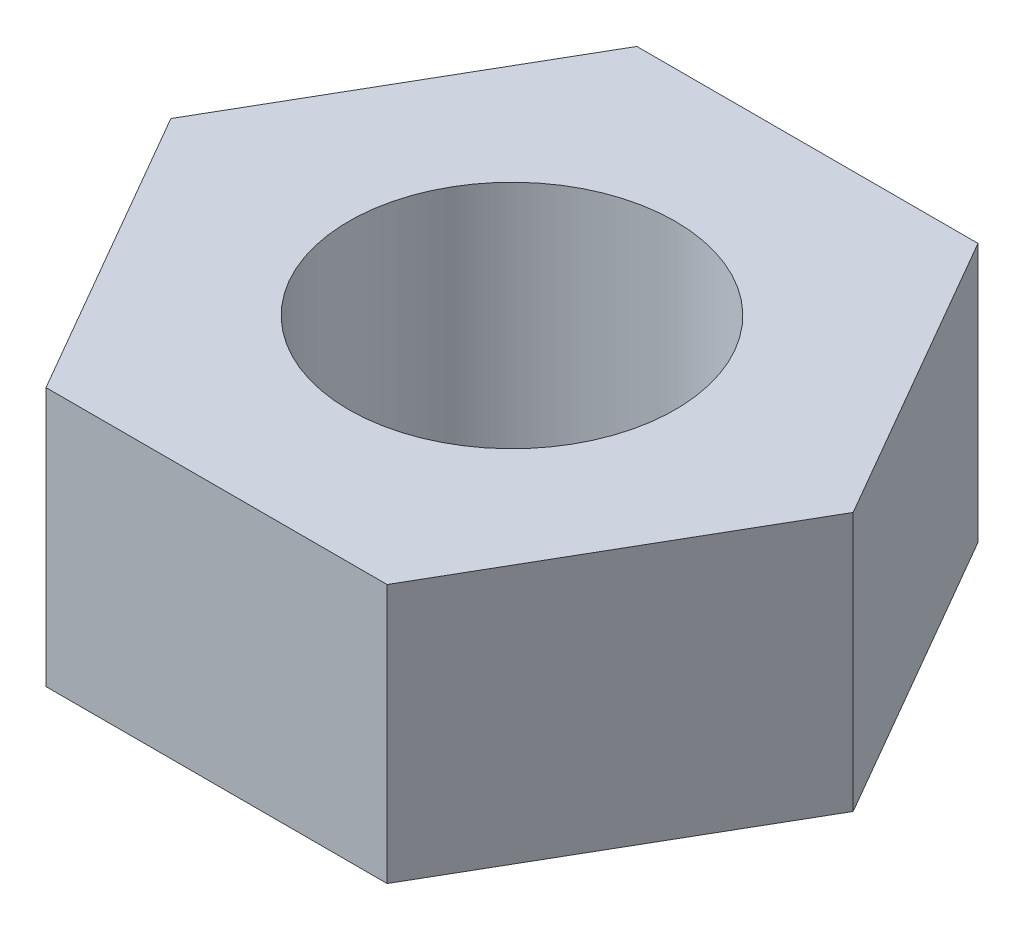
ISO-10303-21;
HEADER;
FILE_DESCRIPTION(('STEP AP214'),'2;1');
FILE_NAME('part.step','',(''),(''),'','','');
FILE_SCHEMA(('AUTOMOTIVE_DESIGN { 1 0 10303 214 1 1 1 1 }'));
ENDSEC;
DATA;
#1=APPLICATION_CONTEXT('core data for automotive mechanical design processes');
#2=APPLICATION_PROTOCOL_DEFINITION('international standard','automotive_design',2000,#1);
#3=PRODUCT_CONTEXT('',#1,'mechanical');
#4=PRODUCT('Part','Part','',(#3));
#5=PRODUCT_RELATED_PRODUCT_CATEGORY('part','',(#4));
#6=PRODUCT_DEFINITION_FORMATION('','',#4);
#7=PRODUCT_DEFINITION_CONTEXT('part definition',#1,'design');
#8=PRODUCT_DEFINITION('design','',#6,#7);
#9=PRODUCT_DEFINITION_SHAPE('','',#8);
#10=(LENGTH_UNIT() NAMED_UNIT(*) SI_UNIT(.MILLI.,.METRE.));
#11=(NAMED_UNIT(*) PLANE_ANGLE_UNIT() SI_UNIT($,.RADIAN.));
#12=(NAMED_UNIT(*) SI_UNIT($,.STERADIAN.) SOLID_ANGLE_UNIT());
#13=UNCERTAINTY_MEASURE_WITH_UNIT(LENGTH_MEASURE(1.E-05),#10,'distance_accuracy_value','');
#14=(GEOMETRIC_REPRESENTATION_CONTEXT(3) GLOBAL_UNCERTAINTY_ASSIGNED_CONTEXT((#13)) GLOBAL_UNIT_ASSIGNED_CONTEXT((#10,
#11,#12)) REPRESENTATION_CONTEXT('',''));
#15=CARTESIAN_POINT('',(0.,0.,0.));
#16=DIRECTION('',(0.,0.,1.));
#17=DIRECTION('',(1.,0.,0.));
#18=AXIS2_PLACEMENT_3D('',#15,#16,#17);
#19=CARTESIAN_POINT('',(0.,2.38,0.));
#20=DIRECTION('',(0.,1.,0.));
#21=DIRECTION('',(0.,0.,1.));
#22=AXIS2_PLACEMENT_3D('',#19,#20,#21);
#23=PLANE('',#22);
#24=DIRECTION('',(0.499999999999999,0.,-0.866025403784439));
#25=VECTOR('',#24,1.);
#26=CARTESIAN_POINT('',(1.56750598084984,2.38,2.715));
#27=LINE('',#26,#25);
#28=CARTESIAN_POINT('',(1.56750598084984,2.38,2.715));
#29=VERTEX_POINT('',#28);
#30=CARTESIAN_POINT('',(3.13501196169967,2.38,0.));
#31=VERTEX_POINT('',#30);
#32=EDGE_CURVE('E150',#29,#31,#27,.T.);
#33=ORIENTED_EDGE('',*,*,#32,.T.);
#34=DIRECTION('',(-0.5,0.,-0.866025403784439));
#35=VECTOR('',#34,1.);
#36=CARTESIAN_POINT('',(3.13501196169967,2.38,0.));
#37=LINE('',#36,#35);
#38=CARTESIAN_POINT('',(1.56750598084983,2.38,-2.715));
#39=VERTEX_POINT('',#38);
#40=EDGE_CURVE('E98',#31,#39,#37,.T.);
#41=ORIENTED_EDGE('',*,*,#40,.T.);
#42=DIRECTION('',(-1.,0.,0.));
#43=VECTOR('',#42,1.);
#44=CARTESIAN_POINT('',(1.56750598084983,2.38,-2.715));
#45=LINE('',#44,#43);
#46=CARTESIAN_POINT('',(-1.56750598084983,2.38,-2.715));
#47=VERTEX_POINT('',#46);
#48=EDGE_CURVE('E111',#39,#47,#45,.T.);
#49=ORIENTED_EDGE('',*,*,#48,.T.);
#50=DIRECTION('',(-0.5,0.,0.866025403784439));
#51=VECTOR('',#50,1.);
#52=CARTESIAN_POINT('',(-1.56750598084983,2.38,-2.715));
#53=LINE('',#52,#51);
#54=CARTESIAN_POINT('',(-3.13501196169967,2.38,0.));
#55=VERTEX_POINT('',#54);
#56=EDGE_CURVE('E105',#47,#55,#53,.T.);
#57=ORIENTED_EDGE('',*,*,#56,.T.);
#58=DIRECTION('',(0.5,0.,0.866025403784439));
#59=VECTOR('',#58,1.);
#60=CARTESIAN_POINT('',(-3.13501196169967,2.38,0.));
#61=LINE('',#60,#59);
#62=CARTESIAN_POINT('',(-1.56750598084983,2.38,2.715));
#63=VERTEX_POINT('',#62);
#64=EDGE_CURVE('E109',#55,#63,#61,.T.);
#65=ORIENTED_EDGE('',*,*,#64,.T.);
#66=DIRECTION('',(1.,0.,0.));
#67=VECTOR('',#66,1.);
#68=CARTESIAN_POINT('',(-1.56750598084983,2.38,2.715));
#69=LINE('',#68,#67);
#70=EDGE_CURVE('E61',#63,#29,#69,.T.);
#71=ORIENTED_EDGE('',*,*,#70,.T.);
#72=EDGE_LOOP('',(#33,#41,#49,#57,#65,#71));
#73=FACE_BOUND('',#72,.T.);
#74=CARTESIAN_POINT('',(0.,2.38,0.));
#75=DIRECTION('',(0.,1.,0.));
#76=DIRECTION('',(0.,0.,1.));
#77=AXIS2_PLACEMENT_3D('',#74,#75,#76);
#78=CIRCLE('',#77,1.5);
#79=CARTESIAN_POINT('',(0.,2.38,1.5));
#80=VERTEX_POINT('',#79);
#81=EDGE_CURVE('E138',#80,#80,#78,.T.);
#82=ORIENTED_EDGE('',*,*,#81,.F.);
#83=EDGE_LOOP('',(#82));
#84=FACE_BOUND('',#83,.T.);
#85=ADVANCED_FACE('F43',(#73,#84),#23,.T.);
#86=CARTESIAN_POINT('',(0.,0.,0.));
#87=DIRECTION('',(0.,1.,0.));
#88=DIRECTION('',(0.,0.,1.));
#89=AXIS2_PLACEMENT_3D('',#86,#87,#88);
#90=PLANE('',#89);
#91=DIRECTION('',(0.499999999999999,0.,-0.866025403784439));
#92=VECTOR('',#91,1.);
#93=CARTESIAN_POINT('',(1.56750598084984,0.,2.715));
#94=LINE('',#93,#92);
#95=CARTESIAN_POINT('',(1.56750598084984,0.,2.715));
#96=VERTEX_POINT('',#95);
#97=CARTESIAN_POINT('',(3.13501196169967,0.,0.));
#98=VERTEX_POINT('',#97);
#99=EDGE_CURVE('E133',#96,#98,#94,.T.);
#100=ORIENTED_EDGE('',*,*,#99,.F.);
#101=DIRECTION('',(1.,0.,0.));
#102=VECTOR('',#101,1.);
#103=CARTESIAN_POINT('',(-1.56750598084983,0.,2.715));
#104=LINE('',#103,#102);
#105=CARTESIAN_POINT('',(-1.56750598084983,0.,2.715));
#106=VERTEX_POINT('',#105);
#107=EDGE_CURVE('E90',#106,#96,#104,.T.);
#108=ORIENTED_EDGE('',*,*,#107,.F.);
#109=DIRECTION('',(0.5,0.,0.866025403784439));
#110=VECTOR('',#109,1.);
#111=CARTESIAN_POINT('',(-3.13501196169967,0.,0.));
#112=LINE('',#111,#110);
#113=CARTESIAN_POINT('',(-3.13501196169967,0.,0.));
#114=VERTEX_POINT('',#113);
#115=EDGE_CURVE('E84',#114,#106,#112,.T.);
#116=ORIENTED_EDGE('',*,*,#115,.F.);
#117=DIRECTION('',(-0.5,0.,0.866025403784439));
#118=VECTOR('',#117,1.);
#119=CARTESIAN_POINT('',(-1.56750598084983,0.,-2.715));
#120=LINE('',#119,#118);
#121=CARTESIAN_POINT('',(-1.56750598084983,0.,-2.715));
#122=VERTEX_POINT('',#121);
#123=EDGE_CURVE('E120',#122,#114,#120,.T.);
#124=ORIENTED_EDGE('',*,*,#123,.F.);
#125=DIRECTION('',(-1.,0.,0.));
#126=VECTOR('',#125,1.);
#127=CARTESIAN_POINT('',(1.56750598084983,0.,-2.715));
#128=LINE('',#127,#126);
#129=CARTESIAN_POINT('',(1.56750598084983,0.,-2.715));
#130=VERTEX_POINT('',#129);
#131=EDGE_CURVE('E141',#130,#122,#128,.T.);
#132=ORIENTED_EDGE('',*,*,#131,.F.);
#133=DIRECTION('',(-0.5,0.,-0.866025403784439));
#134=VECTOR('',#133,1.);
#135=CARTESIAN_POINT('',(3.13501196169967,0.,0.));
#136=LINE('',#135,#134);
#137=EDGE_CURVE('E137',#98,#130,#136,.T.);
#138=ORIENTED_EDGE('',*,*,#137,.F.);
#139=EDGE_LOOP('',(#100,#108,#116,#124,#132,#138));
#140=FACE_BOUND('',#139,.T.);
#141=CARTESIAN_POINT('',(0.,0.,0.));
#142=DIRECTION('',(0.,1.,0.));
#143=DIRECTION('',(0.,0.,1.));
#144=AXIS2_PLACEMENT_3D('',#141,#142,#143);
#145=CIRCLE('',#144,1.5);
#146=CARTESIAN_POINT('',(0.,0.,1.5));
#147=VERTEX_POINT('',#146);
#148=EDGE_CURVE('E265',#147,#147,#145,.T.);
#149=ORIENTED_EDGE('',*,*,#148,.T.);
#150=EDGE_LOOP('',(#149));
#151=FACE_BOUND('',#150,.T.);
#152=ADVANCED_FACE('F163',(#140,#151),#90,.F.);
#153=CARTESIAN_POINT('',(1.56750598084984,2.38,2.715));
#154=DIRECTION('',(-0.866025403784439,0.,-0.499999999999999));
#155=DIRECTION('',(-0.499999999999999,0.,0.866025403784439));
#156=AXIS2_PLACEMENT_3D('',#153,#154,#155);
#157=PLANE('',#156);
#158=ORIENTED_EDGE('',*,*,#99,.T.);
#159=DIRECTION('',(0.,-1.,0.));
#160=VECTOR('',#159,1.);
#161=CARTESIAN_POINT('',(3.13501196169967,2.38,0.));
#162=LINE('',#161,#160);
#163=EDGE_CURVE('E11',#31,#98,#162,.T.);
#164=ORIENTED_EDGE('',*,*,#163,.F.);
#165=ORIENTED_EDGE('',*,*,#32,.F.);
#166=DIRECTION('',(0.,-1.,0.));
#167=VECTOR('',#166,1.);
#168=CARTESIAN_POINT('',(1.56750598084984,2.38,2.715));
#169=LINE('',#168,#167);
#170=EDGE_CURVE('E129',#29,#96,#169,.T.);
#171=ORIENTED_EDGE('',*,*,#170,.T.);
#172=EDGE_LOOP('',(#158,#164,#165,#171));
#173=FACE_BOUND('',#172,.T.);
#174=ADVANCED_FACE('F45',(#173),#157,.F.);
#175=CARTESIAN_POINT('',(3.13501196169967,2.38,0.));
#176=DIRECTION('',(-0.866025403784438,0.,0.5));
#177=DIRECTION('',(0.5,0.,0.866025403784439));
#178=AXIS2_PLACEMENT_3D('',#175,#176,#177);
#179=PLANE('',#178);
#180=ORIENTED_EDGE('',*,*,#137,.T.);
#181=DIRECTION('',(0.,-1.,0.));
#182=VECTOR('',#181,1.);
#183=CARTESIAN_POINT('',(1.56750598084983,2.38,-2.715));
#184=LINE('',#183,#182);
#185=EDGE_CURVE('E53',#39,#130,#184,.T.);
#186=ORIENTED_EDGE('',*,*,#185,.F.);
#187=ORIENTED_EDGE('',*,*,#40,.F.);
#188=ORIENTED_EDGE('',*,*,#163,.T.);
#189=EDGE_LOOP('',(#180,#186,#187,#188));
#190=FACE_BOUND('',#189,.T.);
#191=ADVANCED_FACE('F188',(#190),#179,.F.);
#192=CARTESIAN_POINT('',(1.56750598084983,2.38,-2.715));
#193=DIRECTION('',(0.,0.,1.));
#194=DIRECTION('',(1.,0.,0.));
#195=AXIS2_PLACEMENT_3D('',#192,#193,#194);
#196=PLANE('',#195);
#197=ORIENTED_EDGE('',*,*,#131,.T.);
#198=DIRECTION('',(0.,-1.,0.));
#199=VECTOR('',#198,1.);
#200=CARTESIAN_POINT('',(-1.56750598084983,2.38,-2.715));
#201=LINE('',#200,#199);
#202=EDGE_CURVE('E122',#47,#122,#201,.T.);
#203=ORIENTED_EDGE('',*,*,#202,.F.);
#204=ORIENTED_EDGE('',*,*,#48,.F.);
#205=ORIENTED_EDGE('',*,*,#185,.T.);
#206=EDGE_LOOP('',(#197,#203,#204,#205));
#207=FACE_BOUND('',#206,.T.);
#208=ADVANCED_FACE('F160',(#207),#196,.F.);
#209=CARTESIAN_POINT('',(-1.56750598084983,2.38,-2.715));
#210=DIRECTION('',(0.866025403784439,0.,0.5));
#211=DIRECTION('',(0.5,0.,-0.866025403784439));
#212=AXIS2_PLACEMENT_3D('',#209,#210,#211);
#213=PLANE('',#212);
#214=ORIENTED_EDGE('',*,*,#123,.T.);
#215=DIRECTION('',(0.,-1.,0.));
#216=VECTOR('',#215,1.);
#217=CARTESIAN_POINT('',(-3.13501196169967,2.38,0.));
#218=LINE('',#217,#216);
#219=EDGE_CURVE('E117',#55,#114,#218,.T.);
#220=ORIENTED_EDGE('',*,*,#219,.F.);
#221=ORIENTED_EDGE('',*,*,#56,.F.);
#222=ORIENTED_EDGE('',*,*,#202,.T.);
#223=EDGE_LOOP('',(#214,#220,#221,#222));
#224=FACE_BOUND('',#223,.T.);
#225=ADVANCED_FACE('F118',(#224),#213,.F.);
#226=CARTESIAN_POINT('',(-3.13501196169967,2.38,0.));
#227=DIRECTION('',(0.866025403784438,0.,-0.5));
#228=DIRECTION('',(-0.5,0.,-0.866025403784438));
#229=AXIS2_PLACEMENT_3D('',#226,#227,#228);
#230=PLANE('',#229);
#231=ORIENTED_EDGE('',*,*,#115,.T.);
#232=DIRECTION('',(0.,-1.,0.));
#233=VECTOR('',#232,1.);
#234=CARTESIAN_POINT('',(-1.56750598084983,2.38,2.715));
#235=LINE('',#234,#233);
#236=EDGE_CURVE('E123',#63,#106,#235,.T.);
#237=ORIENTED_EDGE('',*,*,#236,.F.);
#238=ORIENTED_EDGE('',*,*,#64,.F.);
#239=ORIENTED_EDGE('',*,*,#219,.T.);
#240=EDGE_LOOP('',(#231,#237,#238,#239));
#241=FACE_BOUND('',#240,.T.);
#242=ADVANCED_FACE('F125',(#241),#230,.F.);
#243=CARTESIAN_POINT('',(-1.56750598084983,2.38,2.715));
#244=DIRECTION('',(0.,0.,-1.));
#245=DIRECTION('',(-1.,0.,0.));
#246=AXIS2_PLACEMENT_3D('',#243,#244,#245);
#247=PLANE('',#246);
#248=ORIENTED_EDGE('',*,*,#107,.T.);
#249=ORIENTED_EDGE('',*,*,#170,.F.);
#250=ORIENTED_EDGE('',*,*,#70,.F.);
#251=ORIENTED_EDGE('',*,*,#236,.T.);
#252=EDGE_LOOP('',(#248,#249,#250,#251));
#253=FACE_BOUND('',#252,.T.);
#254=ADVANCED_FACE('F168',(#253),#247,.F.);
#255=CARTESIAN_POINT('',(0.,2.38,0.));
#256=DIRECTION('',(0.,-1.,0.));
#257=DIRECTION('',(0.,0.,-1.));
#258=AXIS2_PLACEMENT_3D('',#255,#256,#257);
#259=CYLINDRICAL_SURFACE('',#258,1.5);
#260=ORIENTED_EDGE('',*,*,#81,.T.);
#261=EDGE_LOOP('',(#260));
#262=FACE_BOUND('',#261,.T.);
#263=ORIENTED_EDGE('',*,*,#148,.F.);
#264=EDGE_LOOP('',(#263));
#265=FACE_BOUND('',#264,.T.);
#266=ADVANCED_FACE('F170',(#262,#265),#259,.F.);
#267=CLOSED_SHELL('',(#85,#152,#174,#191,#208,#225,#242,#254,#266));
#268=MANIFOLD_SOLID_BREP('B2',#267);
#269=ADVANCED_BREP_SHAPE_REPRESENTATION('',(#18,#268),#14);
#270=SHAPE_DEFINITION_REPRESENTATION(#9,#269);
ENDSEC;
END-ISO-10303-21;
